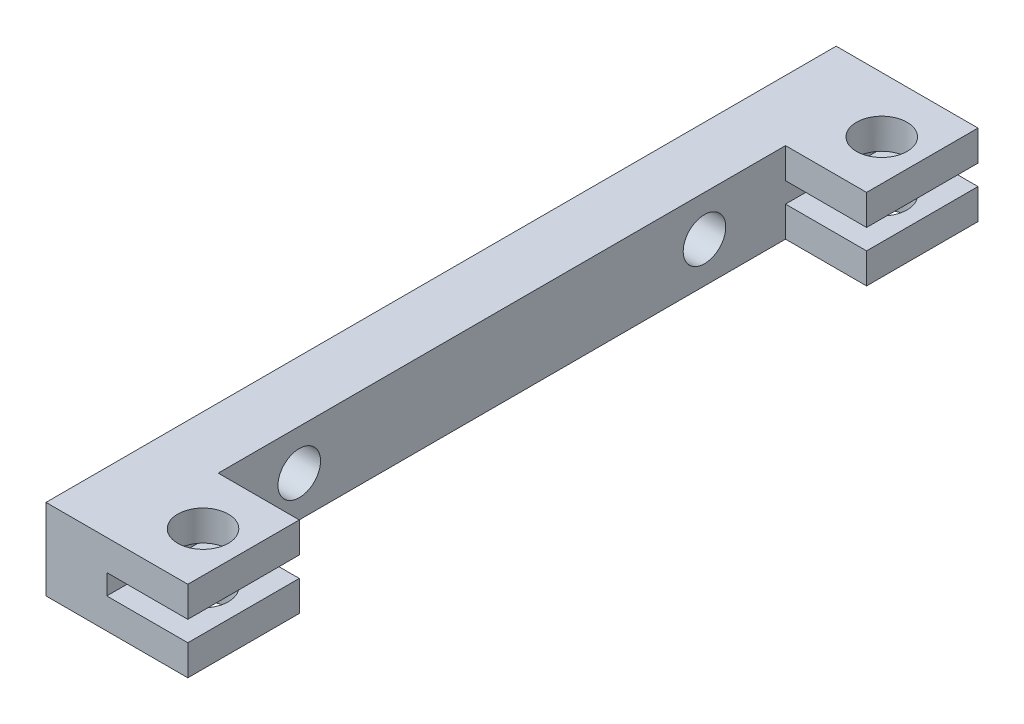
ISO-10303-21;
HEADER;
FILE_DESCRIPTION(('STEP AP214'),'2;1');
FILE_NAME('part.step','',(''),(''),'','','');
FILE_SCHEMA(('AUTOMOTIVE_DESIGN { 1 0 10303 214 1 1 1 1 }'));
ENDSEC;
DATA;
#1=APPLICATION_CONTEXT('core data for automotive mechanical design processes');
#2=APPLICATION_PROTOCOL_DEFINITION('international standard','automotive_design',2000,#1);
#3=PRODUCT_CONTEXT('',#1,'mechanical');
#4=PRODUCT('Part','Part','',(#3));
#5=PRODUCT_RELATED_PRODUCT_CATEGORY('part','',(#4));
#6=PRODUCT_DEFINITION_FORMATION('','',#4);
#7=PRODUCT_DEFINITION_CONTEXT('part definition',#1,'design');
#8=PRODUCT_DEFINITION('design','',#6,#7);
#9=PRODUCT_DEFINITION_SHAPE('','',#8);
#10=(LENGTH_UNIT() NAMED_UNIT(*) SI_UNIT(.MILLI.,.METRE.));
#11=(NAMED_UNIT(*) PLANE_ANGLE_UNIT() SI_UNIT($,.RADIAN.));
#12=(NAMED_UNIT(*) SI_UNIT($,.STERADIAN.) SOLID_ANGLE_UNIT());
#13=UNCERTAINTY_MEASURE_WITH_UNIT(LENGTH_MEASURE(1.E-05),#10,'distance_accuracy_value','');
#14=(GEOMETRIC_REPRESENTATION_CONTEXT(3) GLOBAL_UNCERTAINTY_ASSIGNED_CONTEXT((#13)) GLOBAL_UNIT_ASSIGNED_CONTEXT((#10,
#11,#12)) REPRESENTATION_CONTEXT('',''));
#15=CARTESIAN_POINT('',(0.,0.,0.));
#16=DIRECTION('',(0.,0.,1.));
#17=DIRECTION('',(1.,0.,0.));
#18=AXIS2_PLACEMENT_3D('',#15,#16,#17);
#19=CARTESIAN_POINT('',(-5427.39073995003,1452.78860411653,78.));
#20=DIRECTION('',(-1.,0.,0.));
#21=DIRECTION('',(0.,0.,1.));
#22=AXIS2_PLACEMENT_3D('',#19,#20,#21);
#23=PLANE('',#22);
#24=DIRECTION('',(0.,0.,-1.));
#25=VECTOR('',#24,1.);
#26=CARTESIAN_POINT('',(-5427.39073995003,1449.78860411653,78.));
#27=LINE('',#26,#25);
#28=CARTESIAN_POINT('',(-5427.39073995003,1449.78860411653,78.));
#29=VERTEX_POINT('',#28);
#30=CARTESIAN_POINT('',(-5427.39073995003,1449.78860411653,67.));
#31=VERTEX_POINT('',#30);
#32=EDGE_CURVE('E11',#29,#31,#27,.T.);
#33=ORIENTED_EDGE('',*,*,#32,.T.);
#34=DIRECTION('',(0.,1.,0.));
#35=VECTOR('',#34,1.);
#36=CARTESIAN_POINT('',(-5427.39073995003,1449.78860411653,67.));
#37=LINE('',#36,#35);
#38=CARTESIAN_POINT('',(-5427.39073995003,1452.78860411653,67.));
#39=VERTEX_POINT('',#38);
#40=EDGE_CURVE('E245',#31,#39,#37,.T.);
#41=ORIENTED_EDGE('',*,*,#40,.T.);
#42=DIRECTION('',(0.,0.,-1.));
#43=VECTOR('',#42,1.);
#44=CARTESIAN_POINT('',(-5427.39073995003,1452.78860411653,78.));
#45=LINE('',#44,#43);
#46=CARTESIAN_POINT('',(-5427.39073995003,1452.78860411653,78.));
#47=VERTEX_POINT('',#46);
#48=EDGE_CURVE('E172',#47,#39,#45,.T.);
#49=ORIENTED_EDGE('',*,*,#48,.F.);
#50=DIRECTION('',(0.,1.,0.));
#51=VECTOR('',#50,1.);
#52=CARTESIAN_POINT('',(-5427.39073995003,1452.78860411653,78.));
#53=LINE('',#52,#51);
#54=EDGE_CURVE('E233',#29,#47,#53,.T.);
#55=ORIENTED_EDGE('',*,*,#54,.F.);
#56=EDGE_LOOP('',(#33,#41,#49,#55));
#57=FACE_BOUND('',#56,.T.);
#58=ADVANCED_FACE('F37',(#57),#23,.F.);
#59=CARTESIAN_POINT('',(-5435.39073995003,1452.78860411653,78.));
#60=DIRECTION('',(0.,-1.,0.));
#61=DIRECTION('',(0.,0.,-1.));
#62=AXIS2_PLACEMENT_3D('',#59,#60,#61);
#63=PLANE('',#62);
#64=CARTESIAN_POINT('',(-5431.39073995003,1452.78860411653,72.5));
#65=DIRECTION('',(0.,-1.,0.));
#66=DIRECTION('',(0.,0.,-1.));
#67=AXIS2_PLACEMENT_3D('',#64,#65,#66);
#68=CIRCLE('',#67,2.50000000000016);
#69=CARTESIAN_POINT('',(-5431.39073995003,1452.78860411653,69.9999999999999));
#70=VERTEX_POINT('',#69);
#71=EDGE_CURVE('E260',#70,#70,#68,.T.);
#72=ORIENTED_EDGE('',*,*,#71,.T.);
#73=EDGE_LOOP('',(#72));
#74=FACE_BOUND('',#73,.T.);
#75=ORIENTED_EDGE('',*,*,#48,.T.);
#76=DIRECTION('',(-1.,0.,0.));
#77=VECTOR('',#76,1.);
#78=CARTESIAN_POINT('',(-5435.39073995003,1452.78860411653,67.));
#79=LINE('',#78,#77);
#80=CARTESIAN_POINT('',(-5435.39073995003,1452.78860411653,67.));
#81=VERTEX_POINT('',#80);
#82=EDGE_CURVE('E221',#39,#81,#79,.T.);
#83=ORIENTED_EDGE('',*,*,#82,.T.);
#84=DIRECTION('',(0.,0.,-1.));
#85=VECTOR('',#84,1.);
#86=CARTESIAN_POINT('',(-5435.39073995003,1452.78860411653,78.));
#87=LINE('',#86,#85);
#88=CARTESIAN_POINT('',(-5435.39073995003,1452.78860411653,78.));
#89=VERTEX_POINT('',#88);
#90=EDGE_CURVE('E178',#89,#81,#87,.T.);
#91=ORIENTED_EDGE('',*,*,#90,.F.);
#92=DIRECTION('',(-1.,0.,0.));
#93=VECTOR('',#92,1.);
#94=CARTESIAN_POINT('',(-5435.39073995003,1452.78860411653,78.));
#95=LINE('',#94,#93);
#96=EDGE_CURVE('E231',#47,#89,#95,.T.);
#97=ORIENTED_EDGE('',*,*,#96,.F.);
#98=EDGE_LOOP('',(#75,#83,#91,#97));
#99=FACE_BOUND('',#98,.T.);
#100=ADVANCED_FACE('F361',(#74,#99),#63,.F.);
#101=CARTESIAN_POINT('',(-5435.39073995003,1454.78860411653,78.));
#102=DIRECTION('',(0.,1.,0.));
#103=DIRECTION('',(0.,0.,1.));
#104=AXIS2_PLACEMENT_3D('',#101,#102,#103);
#105=PLANE('',#104);
#106=CARTESIAN_POINT('',(-5431.39073995003,1454.78860411653,72.5));
#107=DIRECTION('',(0.,1.,0.));
#108=DIRECTION('',(0.,0.,1.));
#109=AXIS2_PLACEMENT_3D('',#106,#107,#108);
#110=CIRCLE('',#109,2.50000000000016);
#111=CARTESIAN_POINT('',(-5431.39073995003,1454.78860411653,75.0000000000002));
#112=VERTEX_POINT('',#111);
#113=EDGE_CURVE('E267',#112,#112,#110,.T.);
#114=ORIENTED_EDGE('',*,*,#113,.T.);
#115=EDGE_LOOP('',(#114));
#116=FACE_BOUND('',#115,.T.);
#117=DIRECTION('',(0.,0.,-1.));
#118=VECTOR('',#117,1.);
#119=CARTESIAN_POINT('',(-5435.39073995003,1454.78860411653,78.));
#120=LINE('',#119,#118);
#121=CARTESIAN_POINT('',(-5435.39073995003,1454.78860411653,78.));
#122=VERTEX_POINT('',#121);
#123=CARTESIAN_POINT('',(-5435.39073995003,1454.78860411653,67.));
#124=VERTEX_POINT('',#123);
#125=EDGE_CURVE('E183',#122,#124,#120,.T.);
#126=ORIENTED_EDGE('',*,*,#125,.T.);
#127=DIRECTION('',(1.,0.,0.));
#128=VECTOR('',#127,1.);
#129=CARTESIAN_POINT('',(-5435.39073995003,1454.78860411653,67.));
#130=LINE('',#129,#128);
#131=CARTESIAN_POINT('',(-5427.39073995003,1454.78860411653,67.));
#132=VERTEX_POINT('',#131);
#133=EDGE_CURVE('E238',#124,#132,#130,.T.);
#134=ORIENTED_EDGE('',*,*,#133,.T.);
#135=DIRECTION('',(0.,0.,-1.));
#136=VECTOR('',#135,1.);
#137=CARTESIAN_POINT('',(-5427.39073995003,1454.78860411653,78.));
#138=LINE('',#137,#136);
#139=CARTESIAN_POINT('',(-5427.39073995003,1454.78860411653,78.));
#140=VERTEX_POINT('',#139);
#141=EDGE_CURVE('E187',#140,#132,#138,.T.);
#142=ORIENTED_EDGE('',*,*,#141,.F.);
#143=DIRECTION('',(1.,0.,0.));
#144=VECTOR('',#143,1.);
#145=CARTESIAN_POINT('',(-5435.39073995003,1454.78860411653,78.));
#146=LINE('',#145,#144);
#147=EDGE_CURVE('E227',#122,#140,#146,.T.);
#148=ORIENTED_EDGE('',*,*,#147,.F.);
#149=EDGE_LOOP('',(#126,#134,#142,#148));
#150=FACE_BOUND('',#149,.T.);
#151=ADVANCED_FACE('F357',(#116,#150),#105,.F.);
#152=CARTESIAN_POINT('',(-5427.39073995003,1457.78860411653,78.));
#153=DIRECTION('',(-1.,0.,0.));
#154=DIRECTION('',(0.,0.,1.));
#155=AXIS2_PLACEMENT_3D('',#152,#153,#154);
#156=PLANE('',#155);
#157=ORIENTED_EDGE('',*,*,#141,.T.);
#158=CARTESIAN_POINT('',(-5427.39073995003,1457.78860411653,67.));
#159=VERTEX_POINT('',#158);
#160=EDGE_CURVE('E251',#132,#159,#37,.T.);
#161=ORIENTED_EDGE('',*,*,#160,.T.);
#162=DIRECTION('',(0.,0.,-1.));
#163=VECTOR('',#162,1.);
#164=CARTESIAN_POINT('',(-5427.39073995003,1457.78860411653,78.));
#165=LINE('',#164,#163);
#166=CARTESIAN_POINT('',(-5427.39073995003,1457.78860411653,78.));
#167=VERTEX_POINT('',#166);
#168=EDGE_CURVE('E191',#167,#159,#165,.T.);
#169=ORIENTED_EDGE('',*,*,#168,.F.);
#170=DIRECTION('',(0.,1.,0.));
#171=VECTOR('',#170,1.);
#172=CARTESIAN_POINT('',(-5427.39073995003,1457.78860411653,78.));
#173=LINE('',#172,#171);
#174=EDGE_CURVE('E225',#140,#167,#173,.T.);
#175=ORIENTED_EDGE('',*,*,#174,.F.);
#176=EDGE_LOOP('',(#157,#161,#169,#175));
#177=FACE_BOUND('',#176,.T.);
#178=ADVANCED_FACE('F353',(#177),#156,.F.);
#179=CARTESIAN_POINT('',(-5427.39073995003,1449.78860411653,78.));
#180=DIRECTION('',(0.,1.,0.));
#181=DIRECTION('',(0.,0.,1.));
#182=AXIS2_PLACEMENT_3D('',#179,#180,#181);
#183=PLANE('',#182);
#184=CARTESIAN_POINT('',(-5431.39073995003,1449.78860411653,5.49999999999999));
#185=DIRECTION('',(0.,1.,0.));
#186=DIRECTION('',(0.,0.,-1.));
#187=AXIS2_PLACEMENT_3D('',#184,#185,#186);
#188=CIRCLE('',#187,2.50000000000016);
#189=CARTESIAN_POINT('',(-5431.39073995003,1449.78860411653,2.99999999999983));
#190=VERTEX_POINT('',#189);
#191=EDGE_CURVE('E282',#190,#190,#188,.T.);
#192=ORIENTED_EDGE('',*,*,#191,.T.);
#193=EDGE_LOOP('',(#192));
#194=FACE_BOUND('',#193,.T.);
#195=CARTESIAN_POINT('',(-5431.39073995003,1449.78860411653,72.5));
#196=DIRECTION('',(0.,1.,0.));
#197=DIRECTION('',(0.,0.,1.));
#198=AXIS2_PLACEMENT_3D('',#195,#196,#197);
#199=CIRCLE('',#198,2.50000000000016);
#200=CARTESIAN_POINT('',(-5431.39073995003,1449.78860411653,75.0000000000002));
#201=VERTEX_POINT('',#200);
#202=EDGE_CURVE('E270',#201,#201,#199,.T.);
#203=ORIENTED_EDGE('',*,*,#202,.T.);
#204=EDGE_LOOP('',(#203));
#205=FACE_BOUND('',#204,.T.);
#206=DIRECTION('',(0.,0.,1.));
#207=VECTOR('',#206,1.);
#208=CARTESIAN_POINT('',(-5435.39073995003,1449.78860411653,67.));
#209=LINE('',#208,#207);
#210=CARTESIAN_POINT('',(-5435.39073995003,1449.78860411653,11.));
#211=VERTEX_POINT('',#210);
#212=CARTESIAN_POINT('',(-5435.39073995003,1449.78860411653,67.));
#213=VERTEX_POINT('',#212);
#214=EDGE_CURVE('E157',#211,#213,#209,.T.);
#215=ORIENTED_EDGE('',*,*,#214,.T.);
#216=DIRECTION('',(1.,0.,0.));
#217=VECTOR('',#216,1.);
#218=CARTESIAN_POINT('',(-5427.39073995003,1449.78860411653,67.));
#219=LINE('',#218,#217);
#220=EDGE_CURVE('E261',#213,#31,#219,.T.);
#221=ORIENTED_EDGE('',*,*,#220,.T.);
#222=ORIENTED_EDGE('',*,*,#32,.F.);
#223=DIRECTION('',(1.,0.,0.));
#224=VECTOR('',#223,1.);
#225=CARTESIAN_POINT('',(-5427.39073995003,1449.78860411653,78.));
#226=LINE('',#225,#224);
#227=CARTESIAN_POINT('',(-5441.39073995003,1449.78860411653,78.));
#228=VERTEX_POINT('',#227);
#229=EDGE_CURVE('E203',#228,#29,#226,.T.);
#230=ORIENTED_EDGE('',*,*,#229,.F.);
#231=DIRECTION('',(0.,0.,-1.));
#232=VECTOR('',#231,1.);
#233=CARTESIAN_POINT('',(-5441.39073995003,1449.78860411653,78.));
#234=LINE('',#233,#232);
#235=CARTESIAN_POINT('',(-5441.39073995003,1449.78860411653,0.));
#236=VERTEX_POINT('',#235);
#237=EDGE_CURVE('E198',#228,#236,#234,.T.);
#238=ORIENTED_EDGE('',*,*,#237,.T.);
#239=DIRECTION('',(1.,0.,0.));
#240=VECTOR('',#239,1.);
#241=CARTESIAN_POINT('',(-5427.39073995003,1449.78860411653,0.));
#242=LINE('',#241,#240);
#243=CARTESIAN_POINT('',(-5427.39073995003,1449.78860411653,0.));
#244=VERTEX_POINT('',#243);
#245=EDGE_CURVE('E171',#236,#244,#242,.T.);
#246=ORIENTED_EDGE('',*,*,#245,.T.);
#247=CARTESIAN_POINT('',(-5427.39073995003,1449.78860411653,11.));
#248=VERTEX_POINT('',#247);
#249=EDGE_CURVE('E45',#248,#244,#27,.T.);
#250=ORIENTED_EDGE('',*,*,#249,.F.);
#251=DIRECTION('',(-1.,0.,0.));
#252=VECTOR('',#251,1.);
#253=CARTESIAN_POINT('',(-5427.39073995003,1449.78860411653,11.));
#254=LINE('',#253,#252);
#255=EDGE_CURVE('E149',#248,#211,#254,.T.);
#256=ORIENTED_EDGE('',*,*,#255,.T.);
#257=EDGE_LOOP('',(#215,#221,#222,#230,#238,#246,#250,#256));
#258=FACE_BOUND('',#257,.T.);
#259=ADVANCED_FACE('F39',(#194,#205,#258),#183,.F.);
#260=CARTESIAN_POINT('',(-5427.39073995003,1452.78860411653,11.));
#261=VERTEX_POINT('',#260);
#262=CARTESIAN_POINT('',(-5427.39073995003,1452.78860411653,0.));
#263=VERTEX_POINT('',#262);
#264=EDGE_CURVE('E165',#261,#263,#45,.T.);
#265=ORIENTED_EDGE('',*,*,#264,.F.);
#266=DIRECTION('',(0.,1.,0.));
#267=VECTOR('',#266,1.);
#268=CARTESIAN_POINT('',(-5427.39073995003,1449.78860411653,11.));
#269=LINE('',#268,#267);
#270=EDGE_CURVE('E52',#248,#261,#269,.T.);
#271=ORIENTED_EDGE('',*,*,#270,.F.);
#272=ORIENTED_EDGE('',*,*,#249,.T.);
#273=DIRECTION('',(0.,1.,0.));
#274=VECTOR('',#273,1.);
#275=CARTESIAN_POINT('',(-5427.39073995003,1452.78860411653,0.));
#276=LINE('',#275,#274);
#277=EDGE_CURVE('E218',#244,#263,#276,.T.);
#278=ORIENTED_EDGE('',*,*,#277,.T.);
#279=EDGE_LOOP('',(#265,#271,#272,#278));
#280=FACE_BOUND('',#279,.T.);
#281=ADVANCED_FACE('F162',(#280),#23,.F.);
#282=CARTESIAN_POINT('',(-5431.39073995003,1452.78860411653,5.49999999999999));
#283=DIRECTION('',(0.,-1.,0.));
#284=DIRECTION('',(0.,0.,-1.));
#285=AXIS2_PLACEMENT_3D('',#282,#283,#284);
#286=CIRCLE('',#285,2.50000000000016);
#287=CARTESIAN_POINT('',(-5431.39073995003,1452.78860411653,2.99999999999983));
#288=VERTEX_POINT('',#287);
#289=EDGE_CURVE('E274',#288,#288,#286,.T.);
#290=ORIENTED_EDGE('',*,*,#289,.T.);
#291=EDGE_LOOP('',(#290));
#292=FACE_BOUND('',#291,.T.);
#293=CARTESIAN_POINT('',(-5435.39073995003,1452.78860411653,11.));
#294=VERTEX_POINT('',#293);
#295=CARTESIAN_POINT('',(-5435.39073995003,1452.78860411653,0.));
#296=VERTEX_POINT('',#295);
#297=EDGE_CURVE('E182',#294,#296,#87,.T.);
#298=ORIENTED_EDGE('',*,*,#297,.F.);
#299=DIRECTION('',(1.,0.,0.));
#300=VECTOR('',#299,1.);
#301=CARTESIAN_POINT('',(-5435.39073995003,1452.78860411653,11.));
#302=LINE('',#301,#300);
#303=EDGE_CURVE('E241',#294,#261,#302,.T.);
#304=ORIENTED_EDGE('',*,*,#303,.T.);
#305=ORIENTED_EDGE('',*,*,#264,.T.);
#306=DIRECTION('',(-1.,0.,0.));
#307=VECTOR('',#306,1.);
#308=CARTESIAN_POINT('',(-5435.39073995003,1452.78860411653,0.));
#309=LINE('',#308,#307);
#310=EDGE_CURVE('E215',#263,#296,#309,.T.);
#311=ORIENTED_EDGE('',*,*,#310,.T.);
#312=EDGE_LOOP('',(#298,#304,#305,#311));
#313=FACE_BOUND('',#312,.T.);
#314=ADVANCED_FACE('F326',(#292,#313),#63,.F.);
#315=CARTESIAN_POINT('',(-5435.39073995003,1454.78860411653,78.));
#316=DIRECTION('',(-1.,0.,0.));
#317=DIRECTION('',(0.,0.,1.));
#318=AXIS2_PLACEMENT_3D('',#315,#316,#317);
#319=PLANE('',#318);
#320=CARTESIAN_POINT('',(-5435.39073995003,1453.78860411653,59.));
#321=DIRECTION('',(-1.,0.,0.));
#322=DIRECTION('',(0.,0.,1.));
#323=AXIS2_PLACEMENT_3D('',#320,#321,#322);
#324=CIRCLE('',#323,2.09999999999999);
#325=CARTESIAN_POINT('',(-5435.39073995003,1453.78860411653,61.1));
#326=VERTEX_POINT('',#325);
#327=EDGE_CURVE('E294',#326,#326,#324,.T.);
#328=ORIENTED_EDGE('',*,*,#327,.T.);
#329=EDGE_LOOP('',(#328));
#330=FACE_BOUND('',#329,.T.);
#331=CARTESIAN_POINT('',(-5435.39073995003,1453.78860411653,19.));
#332=DIRECTION('',(-1.,0.,0.));
#333=DIRECTION('',(0.,0.,1.));
#334=AXIS2_PLACEMENT_3D('',#331,#332,#333);
#335=CIRCLE('',#334,2.09999999999999);
#336=CARTESIAN_POINT('',(-5435.39073995003,1453.78860411653,21.1));
#337=VERTEX_POINT('',#336);
#338=EDGE_CURVE('E286',#337,#337,#335,.T.);
#339=ORIENTED_EDGE('',*,*,#338,.T.);
#340=EDGE_LOOP('',(#339));
#341=FACE_BOUND('',#340,.T.);
#342=CARTESIAN_POINT('',(-5435.39073995003,1454.78860411653,11.));
#343=VERTEX_POINT('',#342);
#344=CARTESIAN_POINT('',(-5435.39073995003,1454.78860411653,0.));
#345=VERTEX_POINT('',#344);
#346=EDGE_CURVE('E186',#343,#345,#120,.T.);
#347=ORIENTED_EDGE('',*,*,#346,.F.);
#348=DIRECTION('',(0.,1.,0.));
#349=VECTOR('',#348,1.);
#350=CARTESIAN_POINT('',(-5435.39073995003,1449.78860411653,11.));
#351=LINE('',#350,#349);
#352=CARTESIAN_POINT('',(-5435.39073995003,1457.78860411653,11.));
#353=VERTEX_POINT('',#352);
#354=EDGE_CURVE('E166',#343,#353,#351,.T.);
#355=ORIENTED_EDGE('',*,*,#354,.T.);
#356=DIRECTION('',(0.,0.,1.));
#357=VECTOR('',#356,1.);
#358=CARTESIAN_POINT('',(-5435.39073995003,1457.78860411653,67.));
#359=LINE('',#358,#357);
#360=CARTESIAN_POINT('',(-5435.39073995003,1457.78860411653,67.));
#361=VERTEX_POINT('',#360);
#362=EDGE_CURVE('E255',#353,#361,#359,.T.);
#363=ORIENTED_EDGE('',*,*,#362,.T.);
#364=DIRECTION('',(0.,1.,0.));
#365=VECTOR('',#364,1.);
#366=CARTESIAN_POINT('',(-5435.39073995003,1449.78860411653,67.));
#367=LINE('',#366,#365);
#368=EDGE_CURVE('E248',#124,#361,#367,.T.);
#369=ORIENTED_EDGE('',*,*,#368,.F.);
#370=ORIENTED_EDGE('',*,*,#125,.F.);
#371=DIRECTION('',(0.,1.,0.));
#372=VECTOR('',#371,1.);
#373=CARTESIAN_POINT('',(-5435.39073995003,1454.78860411653,78.));
#374=LINE('',#373,#372);
#375=EDGE_CURVE('E229',#89,#122,#374,.T.);
#376=ORIENTED_EDGE('',*,*,#375,.F.);
#377=ORIENTED_EDGE('',*,*,#90,.T.);
#378=EDGE_CURVE('E249',#213,#81,#367,.T.);
#379=ORIENTED_EDGE('',*,*,#378,.F.);
#380=ORIENTED_EDGE('',*,*,#214,.F.);
#381=EDGE_CURVE('E152',#211,#294,#351,.T.);
#382=ORIENTED_EDGE('',*,*,#381,.T.);
#383=ORIENTED_EDGE('',*,*,#297,.T.);
#384=DIRECTION('',(0.,1.,0.));
#385=VECTOR('',#384,1.);
#386=CARTESIAN_POINT('',(-5435.39073995003,1454.78860411653,0.));
#387=LINE('',#386,#385);
#388=EDGE_CURVE('E212',#296,#345,#387,.T.);
#389=ORIENTED_EDGE('',*,*,#388,.T.);
#390=EDGE_LOOP('',(#347,#355,#363,#369,#370,#376,#377,#379,#380,#382,#383,#389));
#391=FACE_BOUND('',#390,.T.);
#392=ADVANCED_FACE('F329',(#330,#341,#391),#319,.F.);
#393=CARTESIAN_POINT('',(-5431.39073995003,1454.78860411653,5.49999999999999));
#394=DIRECTION('',(0.,1.,0.));
#395=DIRECTION('',(0.,0.,1.));
#396=AXIS2_PLACEMENT_3D('',#393,#394,#395);
#397=CIRCLE('',#396,2.50000000000016);
#398=CARTESIAN_POINT('',(-5431.39073995003,1454.78860411653,8.00000000000015));
#399=VERTEX_POINT('',#398);
#400=EDGE_CURVE('E279',#399,#399,#397,.T.);
#401=ORIENTED_EDGE('',*,*,#400,.T.);
#402=EDGE_LOOP('',(#401));
#403=FACE_BOUND('',#402,.T.);
#404=CARTESIAN_POINT('',(-5427.39073995003,1454.78860411653,11.));
#405=VERTEX_POINT('',#404);
#406=CARTESIAN_POINT('',(-5427.39073995003,1454.78860411653,0.));
#407=VERTEX_POINT('',#406);
#408=EDGE_CURVE('E190',#405,#407,#138,.T.);
#409=ORIENTED_EDGE('',*,*,#408,.F.);
#410=DIRECTION('',(-1.,0.,0.));
#411=VECTOR('',#410,1.);
#412=CARTESIAN_POINT('',(-5435.39073995003,1454.78860411653,11.));
#413=LINE('',#412,#411);
#414=EDGE_CURVE('E243',#405,#343,#413,.T.);
#415=ORIENTED_EDGE('',*,*,#414,.T.);
#416=ORIENTED_EDGE('',*,*,#346,.T.);
#417=DIRECTION('',(1.,0.,0.));
#418=VECTOR('',#417,1.);
#419=CARTESIAN_POINT('',(-5435.39073995003,1454.78860411653,0.));
#420=LINE('',#419,#418);
#421=EDGE_CURVE('E209',#345,#407,#420,.T.);
#422=ORIENTED_EDGE('',*,*,#421,.T.);
#423=EDGE_LOOP('',(#409,#415,#416,#422));
#424=FACE_BOUND('',#423,.T.);
#425=ADVANCED_FACE('F344',(#403,#424),#105,.F.);
#426=CARTESIAN_POINT('',(-5427.39073995003,1457.78860411653,11.));
#427=VERTEX_POINT('',#426);
#428=CARTESIAN_POINT('',(-5427.39073995003,1457.78860411653,0.));
#429=VERTEX_POINT('',#428);
#430=EDGE_CURVE('E194',#427,#429,#165,.T.);
#431=ORIENTED_EDGE('',*,*,#430,.F.);
#432=EDGE_CURVE('E60',#405,#427,#269,.T.);
#433=ORIENTED_EDGE('',*,*,#432,.F.);
#434=ORIENTED_EDGE('',*,*,#408,.T.);
#435=DIRECTION('',(0.,1.,0.));
#436=VECTOR('',#435,1.);
#437=CARTESIAN_POINT('',(-5427.39073995003,1457.78860411653,0.));
#438=LINE('',#437,#436);
#439=EDGE_CURVE('E206',#407,#429,#438,.T.);
#440=ORIENTED_EDGE('',*,*,#439,.T.);
#441=EDGE_LOOP('',(#431,#433,#434,#440));
#442=FACE_BOUND('',#441,.T.);
#443=ADVANCED_FACE('F341',(#442),#156,.F.);
#444=CARTESIAN_POINT('',(-5427.39073995003,1457.78860411653,78.));
#445=DIRECTION('',(0.,-1.,0.));
#446=DIRECTION('',(0.,0.,-1.));
#447=AXIS2_PLACEMENT_3D('',#444,#445,#446);
#448=PLANE('',#447);
#449=CARTESIAN_POINT('',(-5431.39073995003,1457.78860411653,5.49999999999999));
#450=DIRECTION('',(0.,1.,0.));
#451=DIRECTION('',(0.,0.,-1.));
#452=AXIS2_PLACEMENT_3D('',#449,#450,#451);
#453=CIRCLE('',#452,2.50000000000016);
#454=CARTESIAN_POINT('',(-5431.39073995003,1457.78860411653,2.99999999999983));
#455=VERTEX_POINT('',#454);
#456=EDGE_CURVE('E283',#455,#455,#453,.T.);
#457=ORIENTED_EDGE('',*,*,#456,.F.);
#458=EDGE_LOOP('',(#457));
#459=FACE_BOUND('',#458,.T.);
#460=CARTESIAN_POINT('',(-5431.39073995003,1457.78860411653,72.5));
#461=DIRECTION('',(0.,1.,0.));
#462=DIRECTION('',(0.,0.,1.));
#463=AXIS2_PLACEMENT_3D('',#460,#461,#462);
#464=CIRCLE('',#463,2.50000000000016);
#465=CARTESIAN_POINT('',(-5431.39073995003,1457.78860411653,75.0000000000002));
#466=VERTEX_POINT('',#465);
#467=EDGE_CURVE('E271',#466,#466,#464,.T.);
#468=ORIENTED_EDGE('',*,*,#467,.F.);
#469=EDGE_LOOP('',(#468));
#470=FACE_BOUND('',#469,.T.);
#471=ORIENTED_EDGE('',*,*,#168,.T.);
#472=DIRECTION('',(1.,0.,0.));
#473=VECTOR('',#472,1.);
#474=CARTESIAN_POINT('',(-5427.39073995003,1457.78860411653,67.));
#475=LINE('',#474,#473);
#476=EDGE_CURVE('E158',#361,#159,#475,.T.);
#477=ORIENTED_EDGE('',*,*,#476,.F.);
#478=ORIENTED_EDGE('',*,*,#362,.F.);
#479=DIRECTION('',(-1.,0.,0.));
#480=VECTOR('',#479,1.);
#481=CARTESIAN_POINT('',(-5427.39073995003,1457.78860411653,11.));
#482=LINE('',#481,#480);
#483=EDGE_CURVE('E258',#427,#353,#482,.T.);
#484=ORIENTED_EDGE('',*,*,#483,.F.);
#485=ORIENTED_EDGE('',*,*,#430,.T.);
#486=DIRECTION('',(-1.,0.,0.));
#487=VECTOR('',#486,1.);
#488=CARTESIAN_POINT('',(-5427.39073995003,1457.78860411653,0.));
#489=LINE('',#488,#487);
#490=CARTESIAN_POINT('',(-5441.39073995003,1457.78860411653,0.));
#491=VERTEX_POINT('',#490);
#492=EDGE_CURVE('E204',#429,#491,#489,.T.);
#493=ORIENTED_EDGE('',*,*,#492,.T.);
#494=DIRECTION('',(0.,0.,-1.));
#495=VECTOR('',#494,1.);
#496=CARTESIAN_POINT('',(-5441.39073995003,1457.78860411653,78.));
#497=LINE('',#496,#495);
#498=CARTESIAN_POINT('',(-5441.39073995003,1457.78860411653,78.));
#499=VERTEX_POINT('',#498);
#500=EDGE_CURVE('E195',#499,#491,#497,.T.);
#501=ORIENTED_EDGE('',*,*,#500,.F.);
#502=DIRECTION('',(-1.,0.,0.));
#503=VECTOR('',#502,1.);
#504=CARTESIAN_POINT('',(-5427.39073995003,1457.78860411653,78.));
#505=LINE('',#504,#503);
#506=EDGE_CURVE('E223',#167,#499,#505,.T.);
#507=ORIENTED_EDGE('',*,*,#506,.F.);
#508=EDGE_LOOP('',(#471,#477,#478,#484,#485,#493,#501,#507));
#509=FACE_BOUND('',#508,.T.);
#510=ADVANCED_FACE('F308',(#459,#470,#509),#448,.F.);
#511=CARTESIAN_POINT('',(-5441.39073995003,1449.78860411653,78.));
#512=DIRECTION('',(1.,0.,0.));
#513=DIRECTION('',(0.,0.,-1.));
#514=AXIS2_PLACEMENT_3D('',#511,#512,#513);
#515=PLANE('',#514);
#516=CARTESIAN_POINT('',(-5441.39073995003,1453.78860411653,59.));
#517=DIRECTION('',(-1.,0.,0.));
#518=DIRECTION('',(0.,0.,1.));
#519=AXIS2_PLACEMENT_3D('',#516,#517,#518);
#520=CIRCLE('',#519,2.09999999999999);
#521=CARTESIAN_POINT('',(-5441.39073995003,1453.78860411653,61.1));
#522=VERTEX_POINT('',#521);
#523=EDGE_CURVE('E297',#522,#522,#520,.T.);
#524=ORIENTED_EDGE('',*,*,#523,.F.);
#525=EDGE_LOOP('',(#524));
#526=FACE_BOUND('',#525,.T.);
#527=CARTESIAN_POINT('',(-5441.39073995003,1453.78860411653,19.));
#528=DIRECTION('',(-1.,0.,0.));
#529=DIRECTION('',(0.,0.,1.));
#530=AXIS2_PLACEMENT_3D('',#527,#528,#529);
#531=CIRCLE('',#530,2.09999999999999);
#532=CARTESIAN_POINT('',(-5441.39073995003,1453.78860411653,21.1));
#533=VERTEX_POINT('',#532);
#534=EDGE_CURVE('E291',#533,#533,#531,.T.);
#535=ORIENTED_EDGE('',*,*,#534,.F.);
#536=EDGE_LOOP('',(#535));
#537=FACE_BOUND('',#536,.T.);
#538=DIRECTION('',(0.,-1.,0.));
#539=VECTOR('',#538,1.);
#540=CARTESIAN_POINT('',(-5441.39073995003,1449.78860411653,0.));
#541=LINE('',#540,#539);
#542=EDGE_CURVE('E201',#491,#236,#541,.T.);
#543=ORIENTED_EDGE('',*,*,#542,.T.);
#544=ORIENTED_EDGE('',*,*,#237,.F.);
#545=DIRECTION('',(0.,-1.,0.));
#546=VECTOR('',#545,1.);
#547=CARTESIAN_POINT('',(-5441.39073995003,1449.78860411653,78.));
#548=LINE('',#547,#546);
#549=EDGE_CURVE('E200',#499,#228,#548,.T.);
#550=ORIENTED_EDGE('',*,*,#549,.F.);
#551=ORIENTED_EDGE('',*,*,#500,.T.);
#552=EDGE_LOOP('',(#543,#544,#550,#551));
#553=FACE_BOUND('',#552,.T.);
#554=ADVANCED_FACE('F304',(#526,#537,#553),#515,.F.);
#555=CARTESIAN_POINT('',(0.,0.,78.));
#556=DIRECTION('',(0.,0.,-1.));
#557=DIRECTION('',(-1.,0.,0.));
#558=AXIS2_PLACEMENT_3D('',#555,#556,#557);
#559=PLANE('',#558);
#560=ORIENTED_EDGE('',*,*,#229,.T.);
#561=ORIENTED_EDGE('',*,*,#54,.T.);
#562=ORIENTED_EDGE('',*,*,#96,.T.);
#563=ORIENTED_EDGE('',*,*,#375,.T.);
#564=ORIENTED_EDGE('',*,*,#147,.T.);
#565=ORIENTED_EDGE('',*,*,#174,.T.);
#566=ORIENTED_EDGE('',*,*,#506,.T.);
#567=ORIENTED_EDGE('',*,*,#549,.T.);
#568=EDGE_LOOP('',(#560,#561,#562,#563,#564,#565,#566,#567));
#569=FACE_BOUND('',#568,.T.);
#570=ADVANCED_FACE('F307',(#569),#559,.F.);
#571=CARTESIAN_POINT('',(0.,0.,0.));
#572=DIRECTION('',(0.,0.,-1.));
#573=DIRECTION('',(-1.,0.,0.));
#574=AXIS2_PLACEMENT_3D('',#571,#572,#573);
#575=PLANE('',#574);
#576=ORIENTED_EDGE('',*,*,#245,.F.);
#577=ORIENTED_EDGE('',*,*,#542,.F.);
#578=ORIENTED_EDGE('',*,*,#492,.F.);
#579=ORIENTED_EDGE('',*,*,#439,.F.);
#580=ORIENTED_EDGE('',*,*,#421,.F.);
#581=ORIENTED_EDGE('',*,*,#388,.F.);
#582=ORIENTED_EDGE('',*,*,#310,.F.);
#583=ORIENTED_EDGE('',*,*,#277,.F.);
#584=EDGE_LOOP('',(#576,#577,#578,#579,#580,#581,#582,#583));
#585=FACE_BOUND('',#584,.T.);
#586=ADVANCED_FACE('F320',(#585),#575,.T.);
#587=CARTESIAN_POINT('',(-5427.39073995003,1449.78860411653,11.));
#588=DIRECTION('',(0.,0.,-1.));
#589=DIRECTION('',(-1.,0.,0.));
#590=AXIS2_PLACEMENT_3D('',#587,#588,#589);
#591=PLANE('',#590);
#592=ORIENTED_EDGE('',*,*,#432,.T.);
#593=ORIENTED_EDGE('',*,*,#483,.T.);
#594=ORIENTED_EDGE('',*,*,#354,.F.);
#595=ORIENTED_EDGE('',*,*,#414,.F.);
#596=EDGE_LOOP('',(#592,#593,#594,#595));
#597=FACE_BOUND('',#596,.T.);
#598=ADVANCED_FACE('F348',(#597),#591,.F.);
#599=CARTESIAN_POINT('',(-5427.39073995003,1449.78860411653,67.));
#600=DIRECTION('',(0.,0.,1.));
#601=DIRECTION('',(1.,0.,0.));
#602=AXIS2_PLACEMENT_3D('',#599,#600,#601);
#603=PLANE('',#602);
#604=ORIENTED_EDGE('',*,*,#368,.T.);
#605=ORIENTED_EDGE('',*,*,#476,.T.);
#606=ORIENTED_EDGE('',*,*,#160,.F.);
#607=ORIENTED_EDGE('',*,*,#133,.F.);
#608=EDGE_LOOP('',(#604,#605,#606,#607));
#609=FACE_BOUND('',#608,.T.);
#610=ADVANCED_FACE('F351',(#609),#603,.F.);
#611=ORIENTED_EDGE('',*,*,#40,.F.);
#612=ORIENTED_EDGE('',*,*,#220,.F.);
#613=ORIENTED_EDGE('',*,*,#378,.T.);
#614=ORIENTED_EDGE('',*,*,#82,.F.);
#615=EDGE_LOOP('',(#611,#612,#613,#614));
#616=FACE_BOUND('',#615,.T.);
#617=ADVANCED_FACE('F362',(#616),#603,.F.);
#618=ORIENTED_EDGE('',*,*,#381,.F.);
#619=ORIENTED_EDGE('',*,*,#255,.F.);
#620=ORIENTED_EDGE('',*,*,#270,.T.);
#621=ORIENTED_EDGE('',*,*,#303,.F.);
#622=EDGE_LOOP('',(#618,#619,#620,#621));
#623=FACE_BOUND('',#622,.T.);
#624=ADVANCED_FACE('F150',(#623),#591,.F.);
#625=CARTESIAN_POINT('',(-5431.39073995003,1449.78860411653,72.5));
#626=DIRECTION('',(0.,1.,0.));
#627=DIRECTION('',(0.,0.,1.));
#628=AXIS2_PLACEMENT_3D('',#625,#626,#627);
#629=CYLINDRICAL_SURFACE('',#628,2.50000000000016);
#630=ORIENTED_EDGE('',*,*,#467,.T.);
#631=EDGE_LOOP('',(#630));
#632=FACE_BOUND('',#631,.T.);
#633=ORIENTED_EDGE('',*,*,#113,.F.);
#634=EDGE_LOOP('',(#633));
#635=FACE_BOUND('',#634,.T.);
#636=ADVANCED_FACE('F369',(#632,#635),#629,.F.);
#637=ORIENTED_EDGE('',*,*,#202,.F.);
#638=EDGE_LOOP('',(#637));
#639=FACE_BOUND('',#638,.T.);
#640=ORIENTED_EDGE('',*,*,#71,.F.);
#641=EDGE_LOOP('',(#640));
#642=FACE_BOUND('',#641,.T.);
#643=ADVANCED_FACE('F393',(#639,#642),#629,.F.);
#644=CARTESIAN_POINT('',(-5431.39073995003,1449.78860411653,5.49999999999999));
#645=DIRECTION('',(0.,1.,0.));
#646=DIRECTION('',(0.,0.,1.));
#647=AXIS2_PLACEMENT_3D('',#644,#645,#646);
#648=CYLINDRICAL_SURFACE('',#647,2.50000000000016);
#649=ORIENTED_EDGE('',*,*,#456,.T.);
#650=EDGE_LOOP('',(#649));
#651=FACE_BOUND('',#650,.T.);
#652=ORIENTED_EDGE('',*,*,#400,.F.);
#653=EDGE_LOOP('',(#652));
#654=FACE_BOUND('',#653,.T.);
#655=ADVANCED_FACE('F396',(#651,#654),#648,.F.);
#656=ORIENTED_EDGE('',*,*,#191,.F.);
#657=EDGE_LOOP('',(#656));
#658=FACE_BOUND('',#657,.T.);
#659=ORIENTED_EDGE('',*,*,#289,.F.);
#660=EDGE_LOOP('',(#659));
#661=FACE_BOUND('',#660,.T.);
#662=ADVANCED_FACE('F402',(#658,#661),#648,.F.);
#663=CARTESIAN_POINT('',(-5441.39073995003,1453.78860411653,19.));
#664=DIRECTION('',(-1.,0.,0.));
#665=DIRECTION('',(0.,0.,1.));
#666=AXIS2_PLACEMENT_3D('',#663,#664,#665);
#667=CYLINDRICAL_SURFACE('',#666,2.09999999999999);
#668=ORIENTED_EDGE('',*,*,#534,.T.);
#669=EDGE_LOOP('',(#668));
#670=FACE_BOUND('',#669,.T.);
#671=ORIENTED_EDGE('',*,*,#338,.F.);
#672=EDGE_LOOP('',(#671));
#673=FACE_BOUND('',#672,.T.);
#674=ADVANCED_FACE('F408',(#670,#673),#667,.F.);
#675=CARTESIAN_POINT('',(-5441.39073995003,1453.78860411653,59.));
#676=DIRECTION('',(-1.,0.,0.));
#677=DIRECTION('',(0.,0.,1.));
#678=AXIS2_PLACEMENT_3D('',#675,#676,#677);
#679=CYLINDRICAL_SURFACE('',#678,2.09999999999999);
#680=ORIENTED_EDGE('',*,*,#523,.T.);
#681=EDGE_LOOP('',(#680));
#682=FACE_BOUND('',#681,.T.);
#683=ORIENTED_EDGE('',*,*,#327,.F.);
#684=EDGE_LOOP('',(#683));
#685=FACE_BOUND('',#684,.T.);
#686=ADVANCED_FACE('F301',(#682,#685),#679,.F.);
#687=CLOSED_SHELL('',(#58,#100,#151,#178,#259,#281,#314,#392,#425,#443,#510,#554,#570,#586,#598,
#610,#617,#624,#636,#643,#655,#662,#674,#686));
#688=MANIFOLD_SOLID_BREP('B2',#687);
#689=ADVANCED_BREP_SHAPE_REPRESENTATION('',(#18,#688),#14);
#690=SHAPE_DEFINITION_REPRESENTATION(#9,#689);
ENDSEC;
END-ISO-10303-21;
